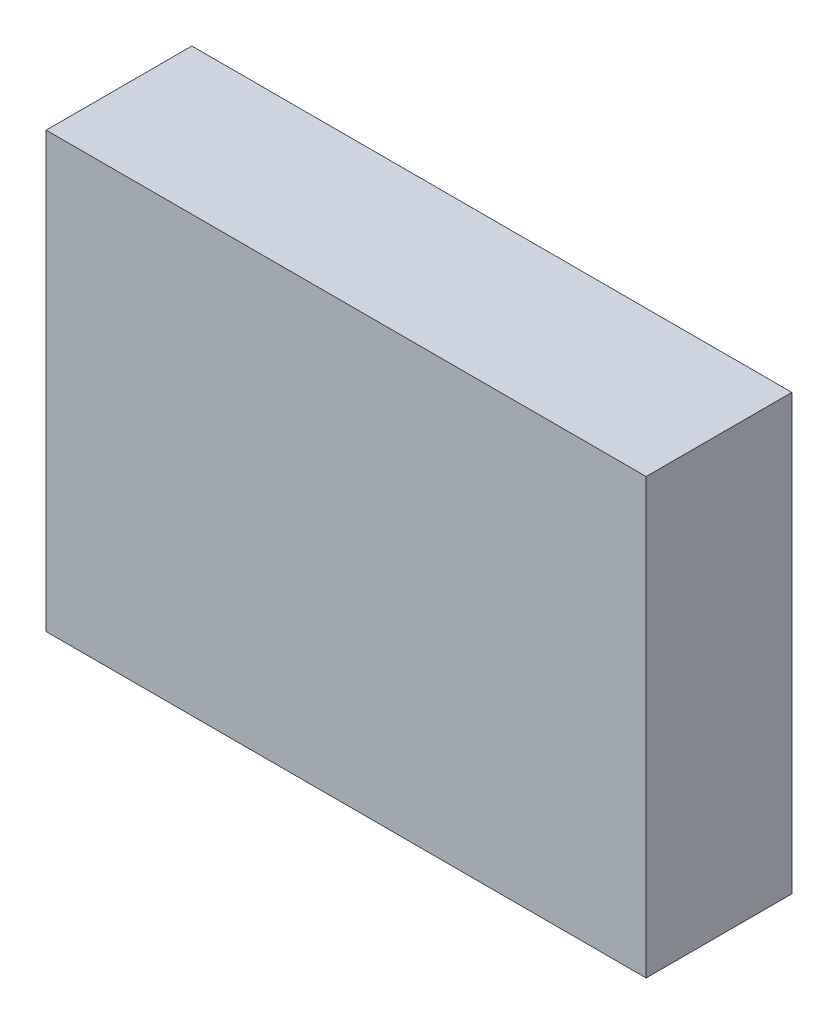
ISO-10303-21;
HEADER;
FILE_DESCRIPTION(('STEP AP214'),'2;1');
FILE_NAME('part.step','',(''),(''),'','','');
FILE_SCHEMA(('AUTOMOTIVE_DESIGN { 1 0 10303 214 1 1 1 1 }'));
ENDSEC;
DATA;
#1=APPLICATION_CONTEXT('core data for automotive mechanical design processes');
#2=APPLICATION_PROTOCOL_DEFINITION('international standard','automotive_design',2000,#1);
#3=PRODUCT_CONTEXT('',#1,'mechanical');
#4=PRODUCT('Part','Part','',(#3));
#5=PRODUCT_RELATED_PRODUCT_CATEGORY('part','',(#4));
#6=PRODUCT_DEFINITION_FORMATION('','',#4);
#7=PRODUCT_DEFINITION_CONTEXT('part definition',#1,'design');
#8=PRODUCT_DEFINITION('design','',#6,#7);
#9=PRODUCT_DEFINITION_SHAPE('','',#8);
#10=(LENGTH_UNIT() NAMED_UNIT(*) SI_UNIT(.MILLI.,.METRE.));
#11=(NAMED_UNIT(*) PLANE_ANGLE_UNIT() SI_UNIT($,.RADIAN.));
#12=(NAMED_UNIT(*) SI_UNIT($,.STERADIAN.) SOLID_ANGLE_UNIT());
#13=UNCERTAINTY_MEASURE_WITH_UNIT(LENGTH_MEASURE(1.E-05),#10,'distance_accuracy_value','');
#14=(GEOMETRIC_REPRESENTATION_CONTEXT(3) GLOBAL_UNCERTAINTY_ASSIGNED_CONTEXT((#13)) GLOBAL_UNIT_ASSIGNED_CONTEXT((#10,
#11,#12)) REPRESENTATION_CONTEXT('',''));
#15=CARTESIAN_POINT('',(0.,0.,0.));
#16=DIRECTION('',(0.,0.,1.));
#17=DIRECTION('',(1.,0.,0.));
#18=AXIS2_PLACEMENT_3D('',#15,#16,#17);
#19=CARTESIAN_POINT('',(-5.24999966,3.80000002,2.54999998));
#20=DIRECTION('',(0.,0.,1.));
#21=DIRECTION('',(1.,0.,0.));
#22=AXIS2_PLACEMENT_3D('',#19,#20,#21);
#23=PLANE('',#22);
#24=DIRECTION('',(0.,1.,0.));
#25=VECTOR('',#24,1.);
#26=CARTESIAN_POINT('',(5.24999966,3.80000002,2.54999998));
#27=LINE('',#26,#25);
#28=CARTESIAN_POINT('',(5.24999966,3.80000002,2.54999998));
#29=VERTEX_POINT('',#28);
#30=CARTESIAN_POINT('',(5.24999966,-3.80000002,2.54999998));
#31=VERTEX_POINT('',#30);
#32=EDGE_CURVE('E52',#29,#31,#27,.F.);
#33=ORIENTED_EDGE('',*,*,#32,.F.);
#34=DIRECTION('',(1.,0.,0.));
#35=VECTOR('',#34,1.);
#36=CARTESIAN_POINT('',(-5.24999966,3.80000002,2.54999998));
#37=LINE('',#36,#35);
#38=CARTESIAN_POINT('',(-5.24999966,3.80000002,2.54999998));
#39=VERTEX_POINT('',#38);
#40=EDGE_CURVE('E67',#39,#29,#37,.T.);
#41=ORIENTED_EDGE('',*,*,#40,.F.);
#42=DIRECTION('',(0.,1.,0.));
#43=VECTOR('',#42,1.);
#44=CARTESIAN_POINT('',(-5.24999966,-3.80000002,2.54999998));
#45=LINE('',#44,#43);
#46=CARTESIAN_POINT('',(-5.24999966,-3.80000002,2.54999998));
#47=VERTEX_POINT('',#46);
#48=EDGE_CURVE('E19',#47,#39,#45,.T.);
#49=ORIENTED_EDGE('',*,*,#48,.F.);
#50=DIRECTION('',(1.,0.,0.));
#51=VECTOR('',#50,1.);
#52=CARTESIAN_POINT('',(5.24999966,-3.80000002,2.54999998));
#53=LINE('',#52,#51);
#54=EDGE_CURVE('E57',#31,#47,#53,.F.);
#55=ORIENTED_EDGE('',*,*,#54,.F.);
#56=EDGE_LOOP('',(#33,#41,#49,#55));
#57=FACE_BOUND('',#56,.T.);
#58=ADVANCED_FACE('F16',(#57),#23,.T.);
#59=CARTESIAN_POINT('',(-5.24999966,-3.80000002,0.));
#60=DIRECTION('',(-1.,0.,0.));
#61=DIRECTION('',(0.,0.,1.));
#62=AXIS2_PLACEMENT_3D('',#59,#60,#61);
#63=PLANE('',#62);
#64=DIRECTION('',(0.,0.,1.));
#65=VECTOR('',#64,1.);
#66=CARTESIAN_POINT('',(-5.24999966,3.80000002,0.));
#67=LINE('',#66,#65);
#68=CARTESIAN_POINT('',(-5.24999966,3.80000002,0.));
#69=VERTEX_POINT('',#68);
#70=EDGE_CURVE('E78',#69,#39,#67,.T.);
#71=ORIENTED_EDGE('',*,*,#70,.F.);
#72=DIRECTION('',(0.,1.,0.));
#73=VECTOR('',#72,1.);
#74=CARTESIAN_POINT('',(-5.24999966,3.80000002,0.));
#75=LINE('',#74,#73);
#76=CARTESIAN_POINT('',(-5.24999966,-3.80000002,0.));
#77=VERTEX_POINT('',#76);
#78=EDGE_CURVE('E73',#69,#77,#75,.F.);
#79=ORIENTED_EDGE('',*,*,#78,.T.);
#80=DIRECTION('',(0.,0.,-1.));
#81=VECTOR('',#80,1.);
#82=CARTESIAN_POINT('',(-5.24999966,-3.80000002,0.));
#83=LINE('',#82,#81);
#84=EDGE_CURVE('E62',#47,#77,#83,.T.);
#85=ORIENTED_EDGE('',*,*,#84,.F.);
#86=ORIENTED_EDGE('',*,*,#48,.T.);
#87=EDGE_LOOP('',(#71,#79,#85,#86));
#88=FACE_BOUND('',#87,.T.);
#89=ADVANCED_FACE('F72',(#88),#63,.T.);
#90=CARTESIAN_POINT('',(5.24999966,-3.80000002,0.));
#91=DIRECTION('',(0.,-1.,0.));
#92=DIRECTION('',(0.,0.,-1.));
#93=AXIS2_PLACEMENT_3D('',#90,#91,#92);
#94=PLANE('',#93);
#95=ORIENTED_EDGE('',*,*,#84,.T.);
#96=DIRECTION('',(1.,0.,0.));
#97=VECTOR('',#96,1.);
#98=CARTESIAN_POINT('',(-5.24999966,-3.80000002,0.));
#99=LINE('',#98,#97);
#100=CARTESIAN_POINT('',(5.24999966,-3.80000002,0.));
#101=VERTEX_POINT('',#100);
#102=EDGE_CURVE('E83',#77,#101,#99,.T.);
#103=ORIENTED_EDGE('',*,*,#102,.T.);
#104=DIRECTION('',(0.,0.,-1.));
#105=VECTOR('',#104,1.);
#106=CARTESIAN_POINT('',(5.24999966,-3.80000002,0.));
#107=LINE('',#106,#105);
#108=EDGE_CURVE('E64',#31,#101,#107,.T.);
#109=ORIENTED_EDGE('',*,*,#108,.F.);
#110=ORIENTED_EDGE('',*,*,#54,.T.);
#111=EDGE_LOOP('',(#95,#103,#109,#110));
#112=FACE_BOUND('',#111,.T.);
#113=ADVANCED_FACE('F59',(#112),#94,.T.);
#114=CARTESIAN_POINT('',(5.24999966,3.80000002,0.));
#115=DIRECTION('',(1.,0.,0.));
#116=DIRECTION('',(0.,0.,-1.));
#117=AXIS2_PLACEMENT_3D('',#114,#115,#116);
#118=PLANE('',#117);
#119=ORIENTED_EDGE('',*,*,#108,.T.);
#120=DIRECTION('',(0.,1.,0.));
#121=VECTOR('',#120,1.);
#122=CARTESIAN_POINT('',(5.24999966,3.80000002,0.));
#123=LINE('',#122,#121);
#124=CARTESIAN_POINT('',(5.24999966,3.80000002,0.));
#125=VERTEX_POINT('',#124);
#126=EDGE_CURVE('E25',#101,#125,#123,.T.);
#127=ORIENTED_EDGE('',*,*,#126,.T.);
#128=DIRECTION('',(0.,0.,1.));
#129=VECTOR('',#128,1.);
#130=CARTESIAN_POINT('',(5.24999966,3.80000002,0.));
#131=LINE('',#130,#129);
#132=EDGE_CURVE('E33',#29,#125,#131,.F.);
#133=ORIENTED_EDGE('',*,*,#132,.F.);
#134=ORIENTED_EDGE('',*,*,#32,.T.);
#135=EDGE_LOOP('',(#119,#127,#133,#134));
#136=FACE_BOUND('',#135,.T.);
#137=ADVANCED_FACE('F87',(#136),#118,.T.);
#138=CARTESIAN_POINT('',(-5.24999966,3.80000002,0.));
#139=DIRECTION('',(0.,1.,0.));
#140=DIRECTION('',(0.,0.,1.));
#141=AXIS2_PLACEMENT_3D('',#138,#139,#140);
#142=PLANE('',#141);
#143=ORIENTED_EDGE('',*,*,#132,.T.);
#144=DIRECTION('',(1.,0.,0.));
#145=VECTOR('',#144,1.);
#146=CARTESIAN_POINT('',(-5.24999966,3.80000002,0.));
#147=LINE('',#146,#145);
#148=EDGE_CURVE('E11',#125,#69,#147,.F.);
#149=ORIENTED_EDGE('',*,*,#148,.T.);
#150=ORIENTED_EDGE('',*,*,#70,.T.);
#151=ORIENTED_EDGE('',*,*,#40,.T.);
#152=EDGE_LOOP('',(#143,#149,#150,#151));
#153=FACE_BOUND('',#152,.T.);
#154=ADVANCED_FACE('F90',(#153),#142,.T.);
#155=CARTESIAN_POINT('',(-5.24999966,3.80000002,0.));
#156=DIRECTION('',(0.,0.,1.));
#157=DIRECTION('',(1.,0.,0.));
#158=AXIS2_PLACEMENT_3D('',#155,#156,#157);
#159=PLANE('',#158);
#160=ORIENTED_EDGE('',*,*,#126,.F.);
#161=ORIENTED_EDGE('',*,*,#102,.F.);
#162=ORIENTED_EDGE('',*,*,#78,.F.);
#163=ORIENTED_EDGE('',*,*,#148,.F.);
#164=EDGE_LOOP('',(#160,#161,#162,#163));
#165=FACE_BOUND('',#164,.T.);
#166=ADVANCED_FACE('F89',(#165),#159,.F.);
#167=CLOSED_SHELL('',(#58,#89,#113,#137,#154,#166));
#168=MANIFOLD_SOLID_BREP('B1',#167);
#169=ADVANCED_BREP_SHAPE_REPRESENTATION('',(#18,#168),#14);
#170=SHAPE_DEFINITION_REPRESENTATION(#9,#169);
ENDSEC;
END-ISO-10303-21;
